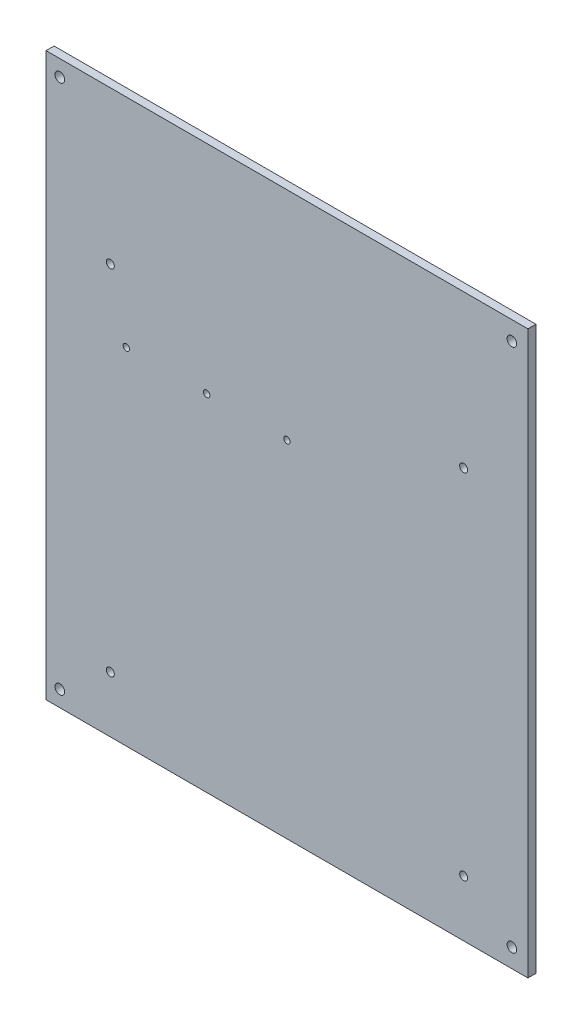
ISO-10303-21;
HEADER;
FILE_DESCRIPTION(('STEP AP214'),'2;1');
FILE_NAME('part.step','',(''),(''),'','','');
FILE_SCHEMA(('AUTOMOTIVE_DESIGN { 1 0 10303 214 1 1 1 1 }'));
ENDSEC;
DATA;
#1=APPLICATION_CONTEXT('core data for automotive mechanical design processes');
#2=APPLICATION_PROTOCOL_DEFINITION('international standard','automotive_design',2000,#1);
#3=PRODUCT_CONTEXT('',#1,'mechanical');
#4=PRODUCT('Part','Part','',(#3));
#5=PRODUCT_RELATED_PRODUCT_CATEGORY('part','',(#4));
#6=PRODUCT_DEFINITION_FORMATION('','',#4);
#7=PRODUCT_DEFINITION_CONTEXT('part definition',#1,'design');
#8=PRODUCT_DEFINITION('design','',#6,#7);
#9=PRODUCT_DEFINITION_SHAPE('','',#8);
#10=(LENGTH_UNIT() NAMED_UNIT(*) SI_UNIT(.MILLI.,.METRE.));
#11=(NAMED_UNIT(*) PLANE_ANGLE_UNIT() SI_UNIT($,.RADIAN.));
#12=(NAMED_UNIT(*) SI_UNIT($,.STERADIAN.) SOLID_ANGLE_UNIT());
#13=UNCERTAINTY_MEASURE_WITH_UNIT(LENGTH_MEASURE(1.E-05),#10,'distance_accuracy_value','');
#14=(GEOMETRIC_REPRESENTATION_CONTEXT(3) GLOBAL_UNCERTAINTY_ASSIGNED_CONTEXT((#13)) GLOBAL_UNIT_ASSIGNED_CONTEXT((#10,
#11,#12)) REPRESENTATION_CONTEXT('',''));
#15=CARTESIAN_POINT('',(0.,0.,0.));
#16=DIRECTION('',(0.,0.,1.));
#17=DIRECTION('',(1.,0.,0.));
#18=AXIS2_PLACEMENT_3D('',#15,#16,#17);
#19=CARTESIAN_POINT('',(0.,0.,5.));
#20=DIRECTION('',(0.,0.,1.));
#21=DIRECTION('',(1.,0.,0.));
#22=AXIS2_PLACEMENT_3D('',#19,#20,#21);
#23=PLANE('',#22);
#24=CARTESIAN_POINT('',(0.,40.0000000000001,5.));
#25=DIRECTION('',(0.,0.,-1.));
#26=DIRECTION('',(-1.,0.,0.));
#27=AXIS2_PLACEMENT_3D('',#24,#25,#26);
#28=CIRCLE('',#27,2.);
#29=CARTESIAN_POINT('',(-2.,40.0000000000001,5.));
#30=VERTEX_POINT('',#29);
#31=EDGE_CURVE('E157',#30,#30,#28,.T.);
#32=ORIENTED_EDGE('',*,*,#31,.T.);
#33=EDGE_LOOP('',(#32));
#34=FACE_BOUND('',#33,.T.);
#35=CARTESIAN_POINT('',(-50.,40.0000000000001,5.));
#36=DIRECTION('',(0.,0.,-1.));
#37=DIRECTION('',(-1.,0.,0.));
#38=AXIS2_PLACEMENT_3D('',#35,#36,#37);
#39=CIRCLE('',#38,2.);
#40=CARTESIAN_POINT('',(-52.,40.0000000000001,5.));
#41=VERTEX_POINT('',#40);
#42=EDGE_CURVE('E171',#41,#41,#39,.T.);
#43=ORIENTED_EDGE('',*,*,#42,.T.);
#44=EDGE_LOOP('',(#43));
#45=FACE_BOUND('',#44,.T.);
#46=CARTESIAN_POINT('',(-100.,40.0000000000001,5.));
#47=DIRECTION('',(0.,0.,-1.));
#48=DIRECTION('',(-1.,0.,0.));
#49=AXIS2_PLACEMENT_3D('',#46,#47,#48);
#50=CIRCLE('',#49,2.);
#51=CARTESIAN_POINT('',(-102.,40.0000000000001,5.));
#52=VERTEX_POINT('',#51);
#53=EDGE_CURVE('E165',#52,#52,#50,.T.);
#54=ORIENTED_EDGE('',*,*,#53,.T.);
#55=EDGE_LOOP('',(#54));
#56=FACE_BOUND('',#55,.T.);
#57=CARTESIAN_POINT('',(-110.,80.,5.));
#58=DIRECTION('',(0.,0.,1.));
#59=DIRECTION('',(1.,0.,0.));
#60=AXIS2_PLACEMENT_3D('',#57,#58,#59);
#61=CIRCLE('',#60,2.49999999999998);
#62=CARTESIAN_POINT('',(-107.5,80.,5.));
#63=VERTEX_POINT('',#62);
#64=EDGE_CURVE('E135',#63,#63,#61,.T.);
#65=ORIENTED_EDGE('',*,*,#64,.F.);
#66=EDGE_LOOP('',(#65));
#67=FACE_BOUND('',#66,.T.);
#68=CARTESIAN_POINT('',(110.,80.,5.));
#69=DIRECTION('',(0.,0.,1.));
#70=DIRECTION('',(1.,0.,0.));
#71=AXIS2_PLACEMENT_3D('',#68,#69,#70);
#72=CIRCLE('',#71,2.49999999999955);
#73=CARTESIAN_POINT('',(112.5,80.,5.));
#74=VERTEX_POINT('',#73);
#75=EDGE_CURVE('E140',#74,#74,#72,.T.);
#76=ORIENTED_EDGE('',*,*,#75,.F.);
#77=EDGE_LOOP('',(#76));
#78=FACE_BOUND('',#77,.T.);
#79=CARTESIAN_POINT('',(110.,-140.000000000002,5.));
#80=DIRECTION('',(0.,0.,1.));
#81=DIRECTION('',(1.,0.,0.));
#82=AXIS2_PLACEMENT_3D('',#79,#80,#81);
#83=CIRCLE('',#82,2.5);
#84=CARTESIAN_POINT('',(112.5,-140.000000000002,5.));
#85=VERTEX_POINT('',#84);
#86=EDGE_CURVE('E143',#85,#85,#83,.T.);
#87=ORIENTED_EDGE('',*,*,#86,.F.);
#88=EDGE_LOOP('',(#87));
#89=FACE_BOUND('',#88,.T.);
#90=CARTESIAN_POINT('',(-110.,-140.,5.));
#91=DIRECTION('',(0.,0.,1.));
#92=DIRECTION('',(1.,0.,0.));
#93=AXIS2_PLACEMENT_3D('',#90,#91,#92);
#94=CIRCLE('',#93,2.5);
#95=CARTESIAN_POINT('',(-107.5,-140.,5.));
#96=VERTEX_POINT('',#95);
#97=EDGE_CURVE('E146',#96,#96,#94,.T.);
#98=ORIENTED_EDGE('',*,*,#97,.F.);
#99=EDGE_LOOP('',(#98));
#100=FACE_BOUND('',#99,.T.);
#101=CARTESIAN_POINT('',(140.,-163.333333333333,5.));
#102=DIRECTION('',(0.,0.,1.));
#103=DIRECTION('',(-1.,0.,0.));
#104=AXIS2_PLACEMENT_3D('',#101,#102,#103);
#105=CIRCLE('',#104,2.99999999999999);
#106=CARTESIAN_POINT('',(137.,-163.333333333333,5.));
#107=VERTEX_POINT('',#106);
#108=EDGE_CURVE('E123',#107,#107,#105,.T.);
#109=ORIENTED_EDGE('',*,*,#108,.F.);
#110=EDGE_LOOP('',(#109));
#111=FACE_BOUND('',#110,.T.);
#112=CARTESIAN_POINT('',(-141.428571428571,165.,5.));
#113=DIRECTION('',(0.,0.,1.));
#114=DIRECTION('',(1.,0.,0.));
#115=AXIS2_PLACEMENT_3D('',#112,#113,#114);
#116=CIRCLE('',#115,2.99999999999999);
#117=CARTESIAN_POINT('',(-138.428571428571,165.,5.));
#118=VERTEX_POINT('',#117);
#119=EDGE_CURVE('E102',#118,#118,#116,.T.);
#120=ORIENTED_EDGE('',*,*,#119,.F.);
#121=EDGE_LOOP('',(#120));
#122=FACE_BOUND('',#121,.T.);
#123=DIRECTION('',(0.,1.,0.));
#124=VECTOR('',#123,1.);
#125=CARTESIAN_POINT('',(150.,175.,5.));
#126=LINE('',#125,#124);
#127=CARTESIAN_POINT('',(150.,-175.,5.));
#128=VERTEX_POINT('',#127);
#129=CARTESIAN_POINT('',(150.,175.,5.));
#130=VERTEX_POINT('',#129);
#131=EDGE_CURVE('E87',#128,#130,#126,.T.);
#132=ORIENTED_EDGE('',*,*,#131,.T.);
#133=DIRECTION('',(-1.,0.,0.));
#134=VECTOR('',#133,1.);
#135=CARTESIAN_POINT('',(-150.,175.,5.));
#136=LINE('',#135,#134);
#137=CARTESIAN_POINT('',(-150.,175.,5.));
#138=VERTEX_POINT('',#137);
#139=EDGE_CURVE('E82',#130,#138,#136,.T.);
#140=ORIENTED_EDGE('',*,*,#139,.T.);
#141=DIRECTION('',(0.,-1.,0.));
#142=VECTOR('',#141,1.);
#143=CARTESIAN_POINT('',(-150.,175.,5.));
#144=LINE('',#143,#142);
#145=CARTESIAN_POINT('',(-150.,-175.,5.));
#146=VERTEX_POINT('',#145);
#147=EDGE_CURVE('E85',#138,#146,#144,.T.);
#148=ORIENTED_EDGE('',*,*,#147,.T.);
#149=DIRECTION('',(1.,0.,0.));
#150=VECTOR('',#149,1.);
#151=CARTESIAN_POINT('',(-150.,-175.,5.));
#152=LINE('',#151,#150);
#153=EDGE_CURVE('E52',#146,#128,#152,.T.);
#154=ORIENTED_EDGE('',*,*,#153,.T.);
#155=EDGE_LOOP('',(#132,#140,#148,#154));
#156=FACE_BOUND('',#155,.T.);
#157=CARTESIAN_POINT('',(140.,163.333333333333,5.));
#158=DIRECTION('',(0.,0.,1.));
#159=DIRECTION('',(1.,0.,0.));
#160=AXIS2_PLACEMENT_3D('',#157,#158,#159);
#161=CIRCLE('',#160,2.99999999999999);
#162=CARTESIAN_POINT('',(143.,163.333333333333,5.));
#163=VERTEX_POINT('',#162);
#164=EDGE_CURVE('E117',#163,#163,#161,.T.);
#165=ORIENTED_EDGE('',*,*,#164,.F.);
#166=EDGE_LOOP('',(#165));
#167=FACE_BOUND('',#166,.T.);
#168=CARTESIAN_POINT('',(-141.428571428571,-165.,5.));
#169=DIRECTION('',(0.,0.,1.));
#170=DIRECTION('',(-1.,0.,0.));
#171=AXIS2_PLACEMENT_3D('',#168,#169,#170);
#172=CIRCLE('',#171,2.99999999999999);
#173=CARTESIAN_POINT('',(-144.428571428572,-165.,5.));
#174=VERTEX_POINT('',#173);
#175=EDGE_CURVE('E129',#174,#174,#172,.T.);
#176=ORIENTED_EDGE('',*,*,#175,.F.);
#177=EDGE_LOOP('',(#176));
#178=FACE_BOUND('',#177,.T.);
#179=ADVANCED_FACE('F35',(#34,#45,#56,#67,#78,#89,#100,#111,#122,#156,#167,#178),#23,.T.);
#180=CARTESIAN_POINT('',(0.,0.,0.));
#181=DIRECTION('',(0.,0.,1.));
#182=DIRECTION('',(1.,0.,0.));
#183=AXIS2_PLACEMENT_3D('',#180,#181,#182);
#184=PLANE('',#183);
#185=CARTESIAN_POINT('',(0.,40.0000000000001,0.));
#186=DIRECTION('',(0.,0.,-1.));
#187=DIRECTION('',(-1.,0.,0.));
#188=AXIS2_PLACEMENT_3D('',#185,#186,#187);
#189=CIRCLE('',#188,2.);
#190=CARTESIAN_POINT('',(-2.,40.0000000000001,0.));
#191=VERTEX_POINT('',#190);
#192=EDGE_CURVE('E174',#191,#191,#189,.T.);
#193=ORIENTED_EDGE('',*,*,#192,.F.);
#194=EDGE_LOOP('',(#193));
#195=FACE_BOUND('',#194,.T.);
#196=CARTESIAN_POINT('',(-50.,40.0000000000001,0.));
#197=DIRECTION('',(0.,0.,-1.));
#198=DIRECTION('',(-1.,0.,0.));
#199=AXIS2_PLACEMENT_3D('',#196,#197,#198);
#200=CIRCLE('',#199,2.);
#201=CARTESIAN_POINT('',(-52.,40.0000000000001,0.));
#202=VERTEX_POINT('',#201);
#203=EDGE_CURVE('E168',#202,#202,#200,.T.);
#204=ORIENTED_EDGE('',*,*,#203,.F.);
#205=EDGE_LOOP('',(#204));
#206=FACE_BOUND('',#205,.T.);
#207=CARTESIAN_POINT('',(-100.,40.0000000000001,0.));
#208=DIRECTION('',(0.,0.,-1.));
#209=DIRECTION('',(-1.,0.,0.));
#210=AXIS2_PLACEMENT_3D('',#207,#208,#209);
#211=CIRCLE('',#210,2.);
#212=CARTESIAN_POINT('',(-102.,40.0000000000001,0.));
#213=VERTEX_POINT('',#212);
#214=EDGE_CURVE('E162',#213,#213,#211,.T.);
#215=ORIENTED_EDGE('',*,*,#214,.F.);
#216=EDGE_LOOP('',(#215));
#217=FACE_BOUND('',#216,.T.);
#218=CARTESIAN_POINT('',(-110.,80.,0.));
#219=DIRECTION('',(0.,0.,-1.));
#220=DIRECTION('',(1.,0.,0.));
#221=AXIS2_PLACEMENT_3D('',#218,#219,#220);
#222=CIRCLE('',#221,2.49999999999998);
#223=CARTESIAN_POINT('',(-107.5,80.,0.));
#224=VERTEX_POINT('',#223);
#225=EDGE_CURVE('E153',#224,#224,#222,.T.);
#226=ORIENTED_EDGE('',*,*,#225,.F.);
#227=EDGE_LOOP('',(#226));
#228=FACE_BOUND('',#227,.T.);
#229=CARTESIAN_POINT('',(110.,80.,0.));
#230=DIRECTION('',(0.,0.,-1.));
#231=DIRECTION('',(1.,0.,0.));
#232=AXIS2_PLACEMENT_3D('',#229,#230,#231);
#233=CIRCLE('',#232,2.49999999999955);
#234=CARTESIAN_POINT('',(112.5,80.,0.));
#235=VERTEX_POINT('',#234);
#236=EDGE_CURVE('E156',#235,#235,#233,.T.);
#237=ORIENTED_EDGE('',*,*,#236,.F.);
#238=EDGE_LOOP('',(#237));
#239=FACE_BOUND('',#238,.T.);
#240=CARTESIAN_POINT('',(110.,-140.000000000002,0.));
#241=DIRECTION('',(0.,0.,-1.));
#242=DIRECTION('',(-1.,0.,0.));
#243=AXIS2_PLACEMENT_3D('',#240,#241,#242);
#244=CIRCLE('',#243,2.5);
#245=CARTESIAN_POINT('',(107.5,-140.000000000002,0.));
#246=VERTEX_POINT('',#245);
#247=EDGE_CURVE('E152',#246,#246,#244,.T.);
#248=ORIENTED_EDGE('',*,*,#247,.F.);
#249=EDGE_LOOP('',(#248));
#250=FACE_BOUND('',#249,.T.);
#251=CARTESIAN_POINT('',(-110.,-140.,0.));
#252=DIRECTION('',(0.,0.,-1.));
#253=DIRECTION('',(-1.,0.,0.));
#254=AXIS2_PLACEMENT_3D('',#251,#252,#253);
#255=CIRCLE('',#254,2.5);
#256=CARTESIAN_POINT('',(-112.5,-140.,0.));
#257=VERTEX_POINT('',#256);
#258=EDGE_CURVE('E149',#257,#257,#255,.T.);
#259=ORIENTED_EDGE('',*,*,#258,.F.);
#260=EDGE_LOOP('',(#259));
#261=FACE_BOUND('',#260,.T.);
#262=DIRECTION('',(0.,1.,0.));
#263=VECTOR('',#262,1.);
#264=CARTESIAN_POINT('',(150.,175.,0.));
#265=LINE('',#264,#263);
#266=CARTESIAN_POINT('',(150.,-175.,0.));
#267=VERTEX_POINT('',#266);
#268=CARTESIAN_POINT('',(150.,175.,0.));
#269=VERTEX_POINT('',#268);
#270=EDGE_CURVE('E99',#267,#269,#265,.T.);
#271=ORIENTED_EDGE('',*,*,#270,.F.);
#272=DIRECTION('',(1.,0.,0.));
#273=VECTOR('',#272,1.);
#274=CARTESIAN_POINT('',(-150.,-175.,0.));
#275=LINE('',#274,#273);
#276=CARTESIAN_POINT('',(-150.,-175.,0.));
#277=VERTEX_POINT('',#276);
#278=EDGE_CURVE('E75',#277,#267,#275,.T.);
#279=ORIENTED_EDGE('',*,*,#278,.F.);
#280=DIRECTION('',(0.,-1.,0.));
#281=VECTOR('',#280,1.);
#282=CARTESIAN_POINT('',(-150.,175.,0.));
#283=LINE('',#282,#281);
#284=CARTESIAN_POINT('',(-150.,175.,0.));
#285=VERTEX_POINT('',#284);
#286=EDGE_CURVE('E69',#285,#277,#283,.T.);
#287=ORIENTED_EDGE('',*,*,#286,.F.);
#288=DIRECTION('',(-1.,0.,0.));
#289=VECTOR('',#288,1.);
#290=CARTESIAN_POINT('',(-150.,175.,0.));
#291=LINE('',#290,#289);
#292=EDGE_CURVE('E91',#269,#285,#291,.T.);
#293=ORIENTED_EDGE('',*,*,#292,.F.);
#294=EDGE_LOOP('',(#271,#279,#287,#293));
#295=FACE_BOUND('',#294,.T.);
#296=CARTESIAN_POINT('',(-141.428571428571,165.,0.));
#297=DIRECTION('',(0.,0.,1.));
#298=DIRECTION('',(1.,0.,0.));
#299=AXIS2_PLACEMENT_3D('',#296,#297,#298);
#300=CIRCLE('',#299,2.99999999999999);
#301=CARTESIAN_POINT('',(-138.428571428571,165.,0.));
#302=VERTEX_POINT('',#301);
#303=EDGE_CURVE('E114',#302,#302,#300,.T.);
#304=ORIENTED_EDGE('',*,*,#303,.T.);
#305=EDGE_LOOP('',(#304));
#306=FACE_BOUND('',#305,.T.);
#307=CARTESIAN_POINT('',(140.,163.333333333333,0.));
#308=DIRECTION('',(0.,0.,1.));
#309=DIRECTION('',(1.,0.,0.));
#310=AXIS2_PLACEMENT_3D('',#307,#308,#309);
#311=CIRCLE('',#310,2.99999999999999);
#312=CARTESIAN_POINT('',(143.,163.333333333333,0.));
#313=VERTEX_POINT('',#312);
#314=EDGE_CURVE('E120',#313,#313,#311,.T.);
#315=ORIENTED_EDGE('',*,*,#314,.T.);
#316=EDGE_LOOP('',(#315));
#317=FACE_BOUND('',#316,.T.);
#318=CARTESIAN_POINT('',(140.,-163.333333333333,0.));
#319=DIRECTION('',(0.,0.,1.));
#320=DIRECTION('',(-1.,0.,0.));
#321=AXIS2_PLACEMENT_3D('',#318,#319,#320);
#322=CIRCLE('',#321,2.99999999999999);
#323=CARTESIAN_POINT('',(137.,-163.333333333333,0.));
#324=VERTEX_POINT('',#323);
#325=EDGE_CURVE('E126',#324,#324,#322,.T.);
#326=ORIENTED_EDGE('',*,*,#325,.T.);
#327=EDGE_LOOP('',(#326));
#328=FACE_BOUND('',#327,.T.);
#329=CARTESIAN_POINT('',(-141.428571428571,-165.,0.));
#330=DIRECTION('',(0.,0.,1.));
#331=DIRECTION('',(-1.,0.,0.));
#332=AXIS2_PLACEMENT_3D('',#329,#330,#331);
#333=CIRCLE('',#332,2.99999999999999);
#334=CARTESIAN_POINT('',(-144.428571428572,-165.,0.));
#335=VERTEX_POINT('',#334);
#336=EDGE_CURVE('E132',#335,#335,#333,.T.);
#337=ORIENTED_EDGE('',*,*,#336,.T.);
#338=EDGE_LOOP('',(#337));
#339=FACE_BOUND('',#338,.T.);
#340=ADVANCED_FACE('F110',(#195,#206,#217,#228,#239,#250,#261,#295,#306,#317,#328,#339),#184,.F.);
#341=CARTESIAN_POINT('',(150.,175.,5.));
#342=DIRECTION('',(-1.,0.,0.));
#343=DIRECTION('',(0.,0.,1.));
#344=AXIS2_PLACEMENT_3D('',#341,#342,#343);
#345=PLANE('',#344);
#346=ORIENTED_EDGE('',*,*,#270,.T.);
#347=DIRECTION('',(0.,0.,-1.));
#348=VECTOR('',#347,1.);
#349=CARTESIAN_POINT('',(150.,175.,5.));
#350=LINE('',#349,#348);
#351=EDGE_CURVE('E11',#130,#269,#350,.T.);
#352=ORIENTED_EDGE('',*,*,#351,.F.);
#353=ORIENTED_EDGE('',*,*,#131,.F.);
#354=DIRECTION('',(0.,0.,-1.));
#355=VECTOR('',#354,1.);
#356=CARTESIAN_POINT('',(150.,-175.,5.));
#357=LINE('',#356,#355);
#358=EDGE_CURVE('E95',#128,#267,#357,.T.);
#359=ORIENTED_EDGE('',*,*,#358,.T.);
#360=EDGE_LOOP('',(#346,#352,#353,#359));
#361=FACE_BOUND('',#360,.T.);
#362=ADVANCED_FACE('F37',(#361),#345,.F.);
#363=CARTESIAN_POINT('',(-150.,175.,5.));
#364=DIRECTION('',(0.,-1.,0.));
#365=DIRECTION('',(1.,0.,0.));
#366=AXIS2_PLACEMENT_3D('',#363,#364,#365);
#367=PLANE('',#366);
#368=ORIENTED_EDGE('',*,*,#292,.T.);
#369=DIRECTION('',(0.,0.,-1.));
#370=VECTOR('',#369,1.);
#371=CARTESIAN_POINT('',(-150.,175.,5.));
#372=LINE('',#371,#370);
#373=EDGE_CURVE('E44',#138,#285,#372,.T.);
#374=ORIENTED_EDGE('',*,*,#373,.F.);
#375=ORIENTED_EDGE('',*,*,#139,.F.);
#376=ORIENTED_EDGE('',*,*,#351,.T.);
#377=EDGE_LOOP('',(#368,#374,#375,#376));
#378=FACE_BOUND('',#377,.T.);
#379=ADVANCED_FACE('F90',(#378),#367,.F.);
#380=CARTESIAN_POINT('',(-150.,175.,5.));
#381=DIRECTION('',(1.,0.,0.));
#382=DIRECTION('',(0.,1.,0.));
#383=AXIS2_PLACEMENT_3D('',#380,#381,#382);
#384=PLANE('',#383);
#385=ORIENTED_EDGE('',*,*,#286,.T.);
#386=DIRECTION('',(0.,0.,-1.));
#387=VECTOR('',#386,1.);
#388=CARTESIAN_POINT('',(-150.,-175.,5.));
#389=LINE('',#388,#387);
#390=EDGE_CURVE('E92',#146,#277,#389,.T.);
#391=ORIENTED_EDGE('',*,*,#390,.F.);
#392=ORIENTED_EDGE('',*,*,#147,.F.);
#393=ORIENTED_EDGE('',*,*,#373,.T.);
#394=EDGE_LOOP('',(#385,#391,#392,#393));
#395=FACE_BOUND('',#394,.T.);
#396=ADVANCED_FACE('F93',(#395),#384,.F.);
#397=CARTESIAN_POINT('',(-150.,-175.,5.));
#398=DIRECTION('',(0.,1.,0.));
#399=DIRECTION('',(-1.,0.,0.));
#400=AXIS2_PLACEMENT_3D('',#397,#398,#399);
#401=PLANE('',#400);
#402=ORIENTED_EDGE('',*,*,#278,.T.);
#403=ORIENTED_EDGE('',*,*,#358,.F.);
#404=ORIENTED_EDGE('',*,*,#153,.F.);
#405=ORIENTED_EDGE('',*,*,#390,.T.);
#406=EDGE_LOOP('',(#402,#403,#404,#405));
#407=FACE_BOUND('',#406,.T.);
#408=ADVANCED_FACE('F107',(#407),#401,.F.);
#409=CARTESIAN_POINT('',(-141.428571428571,165.,5.));
#410=DIRECTION('',(0.,0.,-1.));
#411=DIRECTION('',(-1.,0.,0.));
#412=AXIS2_PLACEMENT_3D('',#409,#410,#411);
#413=CYLINDRICAL_SURFACE('',#412,2.99999999999999);
#414=ORIENTED_EDGE('',*,*,#119,.T.);
#415=EDGE_LOOP('',(#414));
#416=FACE_BOUND('',#415,.T.);
#417=ORIENTED_EDGE('',*,*,#303,.F.);
#418=EDGE_LOOP('',(#417));
#419=FACE_BOUND('',#418,.T.);
#420=ADVANCED_FACE('F227',(#416,#419),#413,.F.);
#421=CARTESIAN_POINT('',(140.,163.333333333333,5.));
#422=DIRECTION('',(0.,0.,-1.));
#423=DIRECTION('',(-1.,0.,0.));
#424=AXIS2_PLACEMENT_3D('',#421,#422,#423);
#425=CYLINDRICAL_SURFACE('',#424,2.99999999999999);
#426=ORIENTED_EDGE('',*,*,#164,.T.);
#427=EDGE_LOOP('',(#426));
#428=FACE_BOUND('',#427,.T.);
#429=ORIENTED_EDGE('',*,*,#314,.F.);
#430=EDGE_LOOP('',(#429));
#431=FACE_BOUND('',#430,.T.);
#432=ADVANCED_FACE('F302',(#428,#431),#425,.F.);
#433=CARTESIAN_POINT('',(140.,-163.333333333333,5.));
#434=DIRECTION('',(0.,0.,-1.));
#435=DIRECTION('',(-1.,0.,0.));
#436=AXIS2_PLACEMENT_3D('',#433,#434,#435);
#437=CYLINDRICAL_SURFACE('',#436,2.99999999999999);
#438=ORIENTED_EDGE('',*,*,#108,.T.);
#439=EDGE_LOOP('',(#438));
#440=FACE_BOUND('',#439,.T.);
#441=ORIENTED_EDGE('',*,*,#325,.F.);
#442=EDGE_LOOP('',(#441));
#443=FACE_BOUND('',#442,.T.);
#444=ADVANCED_FACE('F217',(#440,#443),#437,.F.);
#445=CARTESIAN_POINT('',(-141.428571428571,-165.,5.));
#446=DIRECTION('',(0.,0.,-1.));
#447=DIRECTION('',(-1.,0.,0.));
#448=AXIS2_PLACEMENT_3D('',#445,#446,#447);
#449=CYLINDRICAL_SURFACE('',#448,2.99999999999999);
#450=ORIENTED_EDGE('',*,*,#175,.T.);
#451=EDGE_LOOP('',(#450));
#452=FACE_BOUND('',#451,.T.);
#453=ORIENTED_EDGE('',*,*,#336,.F.);
#454=EDGE_LOOP('',(#453));
#455=FACE_BOUND('',#454,.T.);
#456=ADVANCED_FACE('F207',(#452,#455),#449,.F.);
#457=CARTESIAN_POINT('',(-110.,-140.,10.));
#458=DIRECTION('',(0.,0.,-1.));
#459=DIRECTION('',(-1.,0.,0.));
#460=AXIS2_PLACEMENT_3D('',#457,#458,#459);
#461=CYLINDRICAL_SURFACE('',#460,2.5);
#462=ORIENTED_EDGE('',*,*,#97,.T.);
#463=EDGE_LOOP('',(#462));
#464=FACE_BOUND('',#463,.T.);
#465=ORIENTED_EDGE('',*,*,#258,.T.);
#466=EDGE_LOOP('',(#465));
#467=FACE_BOUND('',#466,.T.);
#468=ADVANCED_FACE('F204',(#464,#467),#461,.F.);
#469=CARTESIAN_POINT('',(110.,-140.000000000002,10.));
#470=DIRECTION('',(0.,0.,-1.));
#471=DIRECTION('',(-1.,0.,0.));
#472=AXIS2_PLACEMENT_3D('',#469,#470,#471);
#473=CYLINDRICAL_SURFACE('',#472,2.5);
#474=ORIENTED_EDGE('',*,*,#86,.T.);
#475=EDGE_LOOP('',(#474));
#476=FACE_BOUND('',#475,.T.);
#477=ORIENTED_EDGE('',*,*,#247,.T.);
#478=EDGE_LOOP('',(#477));
#479=FACE_BOUND('',#478,.T.);
#480=ADVANCED_FACE('F206',(#476,#479),#473,.F.);
#481=CARTESIAN_POINT('',(110.,80.,10.));
#482=DIRECTION('',(0.,0.,-1.));
#483=DIRECTION('',(-1.,0.,0.));
#484=AXIS2_PLACEMENT_3D('',#481,#482,#483);
#485=CYLINDRICAL_SURFACE('',#484,2.49999999999955);
#486=ORIENTED_EDGE('',*,*,#75,.T.);
#487=EDGE_LOOP('',(#486));
#488=FACE_BOUND('',#487,.T.);
#489=ORIENTED_EDGE('',*,*,#236,.T.);
#490=EDGE_LOOP('',(#489));
#491=FACE_BOUND('',#490,.T.);
#492=ADVANCED_FACE('F214',(#488,#491),#485,.F.);
#493=CARTESIAN_POINT('',(-110.,80.,10.));
#494=DIRECTION('',(0.,0.,-1.));
#495=DIRECTION('',(-1.,0.,0.));
#496=AXIS2_PLACEMENT_3D('',#493,#494,#495);
#497=CYLINDRICAL_SURFACE('',#496,2.49999999999998);
#498=ORIENTED_EDGE('',*,*,#64,.T.);
#499=EDGE_LOOP('',(#498));
#500=FACE_BOUND('',#499,.T.);
#501=ORIENTED_EDGE('',*,*,#225,.T.);
#502=EDGE_LOOP('',(#501));
#503=FACE_BOUND('',#502,.T.);
#504=ADVANCED_FACE('F257',(#500,#503),#497,.F.);
#505=CARTESIAN_POINT('',(-100.,40.0000000000001,5.));
#506=DIRECTION('',(0.,0.,-1.));
#507=DIRECTION('',(-1.,0.,0.));
#508=AXIS2_PLACEMENT_3D('',#505,#506,#507);
#509=CYLINDRICAL_SURFACE('',#508,2.);
#510=ORIENTED_EDGE('',*,*,#53,.F.);
#511=EDGE_LOOP('',(#510));
#512=FACE_BOUND('',#511,.T.);
#513=ORIENTED_EDGE('',*,*,#214,.T.);
#514=EDGE_LOOP('',(#513));
#515=FACE_BOUND('',#514,.T.);
#516=ADVANCED_FACE('F252',(#512,#515),#509,.F.);
#517=CARTESIAN_POINT('',(-50.,40.0000000000001,5.));
#518=DIRECTION('',(0.,0.,-1.));
#519=DIRECTION('',(-1.,0.,0.));
#520=AXIS2_PLACEMENT_3D('',#517,#518,#519);
#521=CYLINDRICAL_SURFACE('',#520,2.);
#522=ORIENTED_EDGE('',*,*,#42,.F.);
#523=EDGE_LOOP('',(#522));
#524=FACE_BOUND('',#523,.T.);
#525=ORIENTED_EDGE('',*,*,#203,.T.);
#526=EDGE_LOOP('',(#525));
#527=FACE_BOUND('',#526,.T.);
#528=ADVANCED_FACE('F185',(#524,#527),#521,.F.);
#529=CARTESIAN_POINT('',(0.,40.0000000000001,5.));
#530=DIRECTION('',(0.,0.,-1.));
#531=DIRECTION('',(-1.,0.,0.));
#532=AXIS2_PLACEMENT_3D('',#529,#530,#531);
#533=CYLINDRICAL_SURFACE('',#532,2.);
#534=ORIENTED_EDGE('',*,*,#31,.F.);
#535=EDGE_LOOP('',(#534));
#536=FACE_BOUND('',#535,.T.);
#537=ORIENTED_EDGE('',*,*,#192,.T.);
#538=EDGE_LOOP('',(#537));
#539=FACE_BOUND('',#538,.T.);
#540=ADVANCED_FACE('F182',(#536,#539),#533,.F.);
#541=CLOSED_SHELL('',(#179,#340,#362,#379,#396,#408,#420,#432,#444,#456,#468,#480,#492,#504,
#516,#528,#540));
#542=MANIFOLD_SOLID_BREP('B2',#541);
#543=ADVANCED_BREP_SHAPE_REPRESENTATION('',(#18,#542),#14);
#544=SHAPE_DEFINITION_REPRESENTATION(#9,#543);
ENDSEC;
END-ISO-10303-21;
